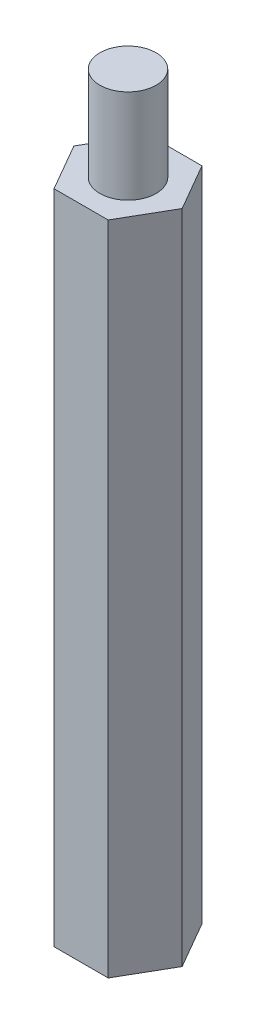
ISO-10303-21;
HEADER;
FILE_DESCRIPTION(('STEP AP214'),'2;1');
FILE_NAME('part.step','',(''),(''),'','','');
FILE_SCHEMA(('AUTOMOTIVE_DESIGN { 1 0 10303 214 1 1 1 1 }'));
ENDSEC;
DATA;
#1=APPLICATION_CONTEXT('core data for automotive mechanical design processes');
#2=APPLICATION_PROTOCOL_DEFINITION('international standard','automotive_design',2000,#1);
#3=PRODUCT_CONTEXT('',#1,'mechanical');
#4=PRODUCT('Part','Part','',(#3));
#5=PRODUCT_RELATED_PRODUCT_CATEGORY('part','',(#4));
#6=PRODUCT_DEFINITION_FORMATION('','',#4);
#7=PRODUCT_DEFINITION_CONTEXT('part definition',#1,'design');
#8=PRODUCT_DEFINITION('design','',#6,#7);
#9=PRODUCT_DEFINITION_SHAPE('','',#8);
#10=(LENGTH_UNIT() NAMED_UNIT(*) SI_UNIT(.MILLI.,.METRE.));
#11=(NAMED_UNIT(*) PLANE_ANGLE_UNIT() SI_UNIT($,.RADIAN.));
#12=(NAMED_UNIT(*) SI_UNIT($,.STERADIAN.) SOLID_ANGLE_UNIT());
#13=UNCERTAINTY_MEASURE_WITH_UNIT(LENGTH_MEASURE(1.E-05),#10,'distance_accuracy_value','');
#14=(GEOMETRIC_REPRESENTATION_CONTEXT(3) GLOBAL_UNCERTAINTY_ASSIGNED_CONTEXT((#13)) GLOBAL_UNIT_ASSIGNED_CONTEXT((#10,
#11,#12)) REPRESENTATION_CONTEXT('',''));
#15=CARTESIAN_POINT('',(0.,0.,0.));
#16=DIRECTION('',(0.,0.,1.));
#17=DIRECTION('',(1.,0.,0.));
#18=AXIS2_PLACEMENT_3D('',#15,#16,#17);
#19=CARTESIAN_POINT('',(1.44337567297409,35.,2.49999999999997));
#20=DIRECTION('',(-0.866025403784442,0.,-0.499999999999995));
#21=DIRECTION('',(-0.499999999999995,0.,0.866025403784442));
#22=AXIS2_PLACEMENT_3D('',#19,#20,#21);
#23=PLANE('',#22);
#24=DIRECTION('',(0.499999999999995,0.,-0.866025403784442));
#25=VECTOR('',#24,1.);
#26=CARTESIAN_POINT('',(1.44337567297409,0.,2.49999999999997));
#27=LINE('',#26,#25);
#28=CARTESIAN_POINT('',(1.44337567297409,0.,2.49999999999997));
#29=VERTEX_POINT('',#28);
#30=CARTESIAN_POINT('',(2.88675134594812,0.,0.));
#31=VERTEX_POINT('',#30);
#32=EDGE_CURVE('E119',#29,#31,#27,.T.);
#33=ORIENTED_EDGE('',*,*,#32,.T.);
#34=DIRECTION('',(0.,-1.,0.));
#35=VECTOR('',#34,1.);
#36=CARTESIAN_POINT('',(2.88675134594812,35.,0.));
#37=LINE('',#36,#35);
#38=CARTESIAN_POINT('',(2.88675134594812,35.,0.));
#39=VERTEX_POINT('',#38);
#40=EDGE_CURVE('E36',#39,#31,#37,.T.);
#41=ORIENTED_EDGE('',*,*,#40,.F.);
#42=DIRECTION('',(0.499999999999995,0.,-0.866025403784442));
#43=VECTOR('',#42,1.);
#44=CARTESIAN_POINT('',(1.44337567297409,35.,2.49999999999997));
#45=LINE('',#44,#43);
#46=CARTESIAN_POINT('',(1.44337567297409,35.,2.49999999999997));
#47=VERTEX_POINT('',#46);
#48=EDGE_CURVE('E130',#47,#39,#45,.T.);
#49=ORIENTED_EDGE('',*,*,#48,.F.);
#50=DIRECTION('',(0.,-1.,0.));
#51=VECTOR('',#50,1.);
#52=CARTESIAN_POINT('',(1.44337567297409,35.,2.49999999999997));
#53=LINE('',#52,#51);
#54=EDGE_CURVE('E115',#47,#29,#53,.T.);
#55=ORIENTED_EDGE('',*,*,#54,.T.);
#56=EDGE_LOOP('',(#33,#41,#49,#55));
#57=FACE_BOUND('',#56,.T.);
#58=ADVANCED_FACE('F33',(#57),#23,.F.);
#59=CARTESIAN_POINT('',(2.88675134594812,35.,0.));
#60=DIRECTION('',(-0.866025403784438,0.,0.500000000000001));
#61=DIRECTION('',(0.500000000000001,0.,0.866025403784438));
#62=AXIS2_PLACEMENT_3D('',#59,#60,#61);
#63=PLANE('',#62);
#64=DIRECTION('',(-0.500000000000001,0.,-0.866025403784438));
#65=VECTOR('',#64,1.);
#66=CARTESIAN_POINT('',(2.88675134594812,0.,0.));
#67=LINE('',#66,#65);
#68=CARTESIAN_POINT('',(1.44337567297405,0.,-2.49999999999999));
#69=VERTEX_POINT('',#68);
#70=EDGE_CURVE('E122',#31,#69,#67,.T.);
#71=ORIENTED_EDGE('',*,*,#70,.T.);
#72=DIRECTION('',(0.,-1.,0.));
#73=VECTOR('',#72,1.);
#74=CARTESIAN_POINT('',(1.44337567297405,35.,-2.49999999999999));
#75=LINE('',#74,#73);
#76=CARTESIAN_POINT('',(1.44337567297405,35.,-2.49999999999999));
#77=VERTEX_POINT('',#76);
#78=EDGE_CURVE('E133',#77,#69,#75,.T.);
#79=ORIENTED_EDGE('',*,*,#78,.F.);
#80=DIRECTION('',(-0.500000000000001,0.,-0.866025403784438));
#81=VECTOR('',#80,1.);
#82=CARTESIAN_POINT('',(2.88675134594812,35.,0.));
#83=LINE('',#82,#81);
#84=EDGE_CURVE('E88',#39,#77,#83,.T.);
#85=ORIENTED_EDGE('',*,*,#84,.F.);
#86=ORIENTED_EDGE('',*,*,#40,.T.);
#87=EDGE_LOOP('',(#71,#79,#85,#86));
#88=FACE_BOUND('',#87,.T.);
#89=ADVANCED_FACE('F138',(#88),#63,.F.);
#90=CARTESIAN_POINT('',(1.44337567297405,35.,-2.49999999999999));
#91=DIRECTION('',(0.,0.,1.));
#92=DIRECTION('',(1.,0.,0.));
#93=AXIS2_PLACEMENT_3D('',#90,#91,#92);
#94=PLANE('',#93);
#95=DIRECTION('',(-1.,0.,0.));
#96=VECTOR('',#95,1.);
#97=CARTESIAN_POINT('',(1.44337567297405,0.,-2.49999999999999));
#98=LINE('',#97,#96);
#99=CARTESIAN_POINT('',(-1.44337567297407,0.,-2.49999999999998));
#100=VERTEX_POINT('',#99);
#101=EDGE_CURVE('E125',#69,#100,#98,.T.);
#102=ORIENTED_EDGE('',*,*,#101,.T.);
#103=DIRECTION('',(0.,-1.,0.));
#104=VECTOR('',#103,1.);
#105=CARTESIAN_POINT('',(-1.44337567297407,35.,-2.49999999999998));
#106=LINE('',#105,#104);
#107=CARTESIAN_POINT('',(-1.44337567297407,35.,-2.49999999999998));
#108=VERTEX_POINT('',#107);
#109=EDGE_CURVE('E110',#108,#100,#106,.T.);
#110=ORIENTED_EDGE('',*,*,#109,.F.);
#111=DIRECTION('',(-1.,0.,0.));
#112=VECTOR('',#111,1.);
#113=CARTESIAN_POINT('',(1.44337567297405,35.,-2.49999999999999));
#114=LINE('',#113,#112);
#115=EDGE_CURVE('E101',#77,#108,#114,.T.);
#116=ORIENTED_EDGE('',*,*,#115,.F.);
#117=ORIENTED_EDGE('',*,*,#78,.T.);
#118=EDGE_LOOP('',(#102,#110,#116,#117));
#119=FACE_BOUND('',#118,.T.);
#120=ADVANCED_FACE('F144',(#119),#94,.F.);
#121=CARTESIAN_POINT('',(-1.44337567297407,35.,-2.49999999999998));
#122=DIRECTION('',(0.866025403784442,0.,0.499999999999995));
#123=DIRECTION('',(0.499999999999995,0.,-0.866025403784442));
#124=AXIS2_PLACEMENT_3D('',#121,#122,#123);
#125=PLANE('',#124);
#126=DIRECTION('',(-0.499999999999995,0.,0.866025403784442));
#127=VECTOR('',#126,1.);
#128=CARTESIAN_POINT('',(-1.44337567297407,0.,-2.49999999999998));
#129=LINE('',#128,#127);
#130=CARTESIAN_POINT('',(-2.88675134594812,0.,0.));
#131=VERTEX_POINT('',#130);
#132=EDGE_CURVE('E109',#100,#131,#129,.T.);
#133=ORIENTED_EDGE('',*,*,#132,.T.);
#134=DIRECTION('',(0.,-1.,0.));
#135=VECTOR('',#134,1.);
#136=CARTESIAN_POINT('',(-2.88675134594812,35.,0.));
#137=LINE('',#136,#135);
#138=CARTESIAN_POINT('',(-2.88675134594812,35.,0.));
#139=VERTEX_POINT('',#138);
#140=EDGE_CURVE('E106',#139,#131,#137,.T.);
#141=ORIENTED_EDGE('',*,*,#140,.F.);
#142=DIRECTION('',(-0.499999999999995,0.,0.866025403784442));
#143=VECTOR('',#142,1.);
#144=CARTESIAN_POINT('',(-1.44337567297407,35.,-2.49999999999998));
#145=LINE('',#144,#143);
#146=EDGE_CURVE('E95',#108,#139,#145,.T.);
#147=ORIENTED_EDGE('',*,*,#146,.F.);
#148=ORIENTED_EDGE('',*,*,#109,.T.);
#149=EDGE_LOOP('',(#133,#141,#147,#148));
#150=FACE_BOUND('',#149,.T.);
#151=ADVANCED_FACE('F107',(#150),#125,.F.);
#152=CARTESIAN_POINT('',(-2.88675134594812,35.,0.));
#153=DIRECTION('',(0.866025403784435,0.,-0.500000000000007));
#154=DIRECTION('',(-0.500000000000007,0.,-0.866025403784435));
#155=AXIS2_PLACEMENT_3D('',#152,#153,#154);
#156=PLANE('',#155);
#157=DIRECTION('',(0.500000000000007,0.,0.866025403784435));
#158=VECTOR('',#157,1.);
#159=CARTESIAN_POINT('',(-2.88675134594812,0.,0.));
#160=LINE('',#159,#158);
#161=CARTESIAN_POINT('',(-1.44337567297404,0.,2.5));
#162=VERTEX_POINT('',#161);
#163=EDGE_CURVE('E73',#131,#162,#160,.T.);
#164=ORIENTED_EDGE('',*,*,#163,.T.);
#165=DIRECTION('',(0.,-1.,0.));
#166=VECTOR('',#165,1.);
#167=CARTESIAN_POINT('',(-1.44337567297404,35.,2.5));
#168=LINE('',#167,#166);
#169=CARTESIAN_POINT('',(-1.44337567297404,35.,2.5));
#170=VERTEX_POINT('',#169);
#171=EDGE_CURVE('E111',#170,#162,#168,.T.);
#172=ORIENTED_EDGE('',*,*,#171,.F.);
#173=DIRECTION('',(0.500000000000007,0.,0.866025403784435));
#174=VECTOR('',#173,1.);
#175=CARTESIAN_POINT('',(-2.88675134594812,35.,0.));
#176=LINE('',#175,#174);
#177=EDGE_CURVE('E99',#139,#170,#176,.T.);
#178=ORIENTED_EDGE('',*,*,#177,.F.);
#179=ORIENTED_EDGE('',*,*,#140,.T.);
#180=EDGE_LOOP('',(#164,#172,#178,#179));
#181=FACE_BOUND('',#180,.T.);
#182=ADVANCED_FACE('F113',(#181),#156,.F.);
#183=CARTESIAN_POINT('',(-1.44337567297404,35.,2.5));
#184=DIRECTION('',(0.,0.,-1.));
#185=DIRECTION('',(-1.,0.,0.));
#186=AXIS2_PLACEMENT_3D('',#183,#184,#185);
#187=PLANE('',#186);
#188=DIRECTION('',(1.,0.,0.));
#189=VECTOR('',#188,1.);
#190=CARTESIAN_POINT('',(-1.44337567297404,0.,2.5));
#191=LINE('',#190,#189);
#192=EDGE_CURVE('E79',#162,#29,#191,.T.);
#193=ORIENTED_EDGE('',*,*,#192,.T.);
#194=ORIENTED_EDGE('',*,*,#54,.F.);
#195=DIRECTION('',(1.,0.,0.));
#196=VECTOR('',#195,1.);
#197=CARTESIAN_POINT('',(-1.44337567297404,35.,2.5));
#198=LINE('',#197,#196);
#199=EDGE_CURVE('E50',#170,#47,#198,.T.);
#200=ORIENTED_EDGE('',*,*,#199,.F.);
#201=ORIENTED_EDGE('',*,*,#171,.T.);
#202=EDGE_LOOP('',(#193,#194,#200,#201));
#203=FACE_BOUND('',#202,.T.);
#204=ADVANCED_FACE('F160',(#203),#187,.F.);
#205=CARTESIAN_POINT('',(0.,35.,0.));
#206=DIRECTION('',(0.,1.,0.));
#207=DIRECTION('',(0.,0.,1.));
#208=AXIS2_PLACEMENT_3D('',#205,#206,#207);
#209=PLANE('',#208);
#210=CARTESIAN_POINT('',(0.,35.,0.));
#211=DIRECTION('',(0.,1.,0.));
#212=DIRECTION('',(0.,0.,1.));
#213=AXIS2_PLACEMENT_3D('',#210,#211,#212);
#214=CIRCLE('',#213,1.5);
#215=CARTESIAN_POINT('',(0.,35.,1.5));
#216=VERTEX_POINT('',#215);
#217=EDGE_CURVE('E11',#216,#216,#214,.T.);
#218=ORIENTED_EDGE('',*,*,#217,.F.);
#219=EDGE_LOOP('',(#218));
#220=FACE_BOUND('',#219,.T.);
#221=ORIENTED_EDGE('',*,*,#48,.T.);
#222=ORIENTED_EDGE('',*,*,#84,.T.);
#223=ORIENTED_EDGE('',*,*,#115,.T.);
#224=ORIENTED_EDGE('',*,*,#146,.T.);
#225=ORIENTED_EDGE('',*,*,#177,.T.);
#226=ORIENTED_EDGE('',*,*,#199,.T.);
#227=EDGE_LOOP('',(#221,#222,#223,#224,#225,#226));
#228=FACE_BOUND('',#227,.T.);
#229=ADVANCED_FACE('F97',(#220,#228),#209,.T.);
#230=CARTESIAN_POINT('',(0.,0.,0.));
#231=DIRECTION('',(0.,1.,0.));
#232=DIRECTION('',(0.,0.,1.));
#233=AXIS2_PLACEMENT_3D('',#230,#231,#232);
#234=PLANE('',#233);
#235=ORIENTED_EDGE('',*,*,#32,.F.);
#236=ORIENTED_EDGE('',*,*,#192,.F.);
#237=ORIENTED_EDGE('',*,*,#163,.F.);
#238=ORIENTED_EDGE('',*,*,#132,.F.);
#239=ORIENTED_EDGE('',*,*,#101,.F.);
#240=ORIENTED_EDGE('',*,*,#70,.F.);
#241=EDGE_LOOP('',(#235,#236,#237,#238,#239,#240));
#242=FACE_BOUND('',#241,.T.);
#243=ADVANCED_FACE('F143',(#242),#234,.F.);
#244=CARTESIAN_POINT('',(0.,40.,0.));
#245=DIRECTION('',(0.,-1.,0.));
#246=DIRECTION('',(0.,0.,-1.));
#247=AXIS2_PLACEMENT_3D('',#244,#245,#246);
#248=CYLINDRICAL_SURFACE('',#247,1.5);
#249=CARTESIAN_POINT('',(0.,40.,0.));
#250=DIRECTION('',(0.,1.,0.));
#251=DIRECTION('',(0.,0.,1.));
#252=AXIS2_PLACEMENT_3D('',#249,#250,#251);
#253=CIRCLE('',#252,1.5);
#254=CARTESIAN_POINT('',(0.,40.,1.5));
#255=VERTEX_POINT('',#254);
#256=EDGE_CURVE('E123',#255,#255,#253,.T.);
#257=ORIENTED_EDGE('',*,*,#256,.F.);
#258=EDGE_LOOP('',(#257));
#259=FACE_BOUND('',#258,.T.);
#260=ORIENTED_EDGE('',*,*,#217,.T.);
#261=EDGE_LOOP('',(#260));
#262=FACE_BOUND('',#261,.T.);
#263=ADVANCED_FACE('F153',(#259,#262),#248,.T.);
#264=CARTESIAN_POINT('',(0.,40.,0.));
#265=DIRECTION('',(0.,1.,0.));
#266=DIRECTION('',(0.,0.,1.));
#267=AXIS2_PLACEMENT_3D('',#264,#265,#266);
#268=PLANE('',#267);
#269=ORIENTED_EDGE('',*,*,#256,.T.);
#270=EDGE_LOOP('',(#269));
#271=FACE_BOUND('',#270,.T.);
#272=ADVANCED_FACE('F151',(#271),#268,.T.);
#273=CLOSED_SHELL('',(#58,#89,#120,#151,#182,#204,#229,#243,#263,#272));
#274=MANIFOLD_SOLID_BREP('B2',#273);
#275=ADVANCED_BREP_SHAPE_REPRESENTATION('',(#18,#274),#14);
#276=SHAPE_DEFINITION_REPRESENTATION(#9,#275);
ENDSEC;
END-ISO-10303-21;
